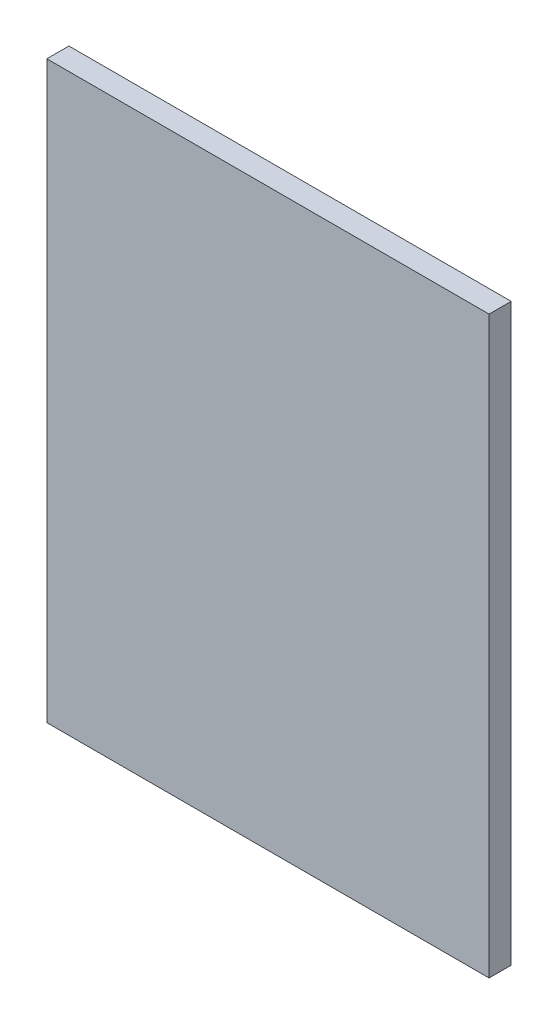
ISO-10303-21;
HEADER;
FILE_DESCRIPTION(('STEP AP214'),'2;1');
FILE_NAME('part.step','',(''),(''),'','','');
FILE_SCHEMA(('AUTOMOTIVE_DESIGN { 1 0 10303 214 1 1 1 1 }'));
ENDSEC;
DATA;
#1=APPLICATION_CONTEXT('core data for automotive mechanical design processes');
#2=APPLICATION_PROTOCOL_DEFINITION('international standard','automotive_design',2000,#1);
#3=PRODUCT_CONTEXT('',#1,'mechanical');
#4=PRODUCT('Part','Part','',(#3));
#5=PRODUCT_RELATED_PRODUCT_CATEGORY('part','',(#4));
#6=PRODUCT_DEFINITION_FORMATION('','',#4);
#7=PRODUCT_DEFINITION_CONTEXT('part definition',#1,'design');
#8=PRODUCT_DEFINITION('design','',#6,#7);
#9=PRODUCT_DEFINITION_SHAPE('','',#8);
#10=(LENGTH_UNIT() NAMED_UNIT(*) SI_UNIT(.MILLI.,.METRE.));
#11=(NAMED_UNIT(*) PLANE_ANGLE_UNIT() SI_UNIT($,.RADIAN.));
#12=(NAMED_UNIT(*) SI_UNIT($,.STERADIAN.) SOLID_ANGLE_UNIT());
#13=UNCERTAINTY_MEASURE_WITH_UNIT(LENGTH_MEASURE(1.E-05),#10,'distance_accuracy_value','');
#14=(GEOMETRIC_REPRESENTATION_CONTEXT(3) GLOBAL_UNCERTAINTY_ASSIGNED_CONTEXT((#13)) GLOBAL_UNIT_ASSIGNED_CONTEXT((#10,
#11,#12)) REPRESENTATION_CONTEXT('',''));
#15=CARTESIAN_POINT('',(0.,0.,0.));
#16=DIRECTION('',(0.,0.,1.));
#17=DIRECTION('',(1.,0.,0.));
#18=AXIS2_PLACEMENT_3D('',#15,#16,#17);
#19=CARTESIAN_POINT('',(-50.,-65.,5.));
#20=DIRECTION('',(1.,0.,0.));
#21=DIRECTION('',(0.,0.,-1.));
#22=AXIS2_PLACEMENT_3D('',#19,#20,#21);
#23=PLANE('',#22);
#24=DIRECTION('',(0.,-1.,0.));
#25=VECTOR('',#24,1.);
#26=CARTESIAN_POINT('',(-50.,-65.,0.));
#27=LINE('',#26,#25);
#28=CARTESIAN_POINT('',(-50.,65.,0.));
#29=VERTEX_POINT('',#28);
#30=CARTESIAN_POINT('',(-50.,-65.,0.));
#31=VERTEX_POINT('',#30);
#32=EDGE_CURVE('E100',#29,#31,#27,.T.);
#33=ORIENTED_EDGE('',*,*,#32,.T.);
#34=DIRECTION('',(0.,0.,-1.));
#35=VECTOR('',#34,1.);
#36=CARTESIAN_POINT('',(-50.,-65.,5.));
#37=LINE('',#36,#35);
#38=CARTESIAN_POINT('',(-50.,-65.,5.));
#39=VERTEX_POINT('',#38);
#40=EDGE_CURVE('E11',#39,#31,#37,.T.);
#41=ORIENTED_EDGE('',*,*,#40,.F.);
#42=DIRECTION('',(0.,-1.,0.));
#43=VECTOR('',#42,1.);
#44=CARTESIAN_POINT('',(-50.,-65.,5.));
#45=LINE('',#44,#43);
#46=CARTESIAN_POINT('',(-50.,65.,5.));
#47=VERTEX_POINT('',#46);
#48=EDGE_CURVE('E88',#47,#39,#45,.T.);
#49=ORIENTED_EDGE('',*,*,#48,.F.);
#50=DIRECTION('',(0.,0.,-1.));
#51=VECTOR('',#50,1.);
#52=CARTESIAN_POINT('',(-50.,65.,5.));
#53=LINE('',#52,#51);
#54=EDGE_CURVE('E96',#47,#29,#53,.T.);
#55=ORIENTED_EDGE('',*,*,#54,.T.);
#56=EDGE_LOOP('',(#33,#41,#49,#55));
#57=FACE_BOUND('',#56,.T.);
#58=ADVANCED_FACE('F37',(#57),#23,.F.);
#59=CARTESIAN_POINT('',(50.,-65.,5.));
#60=DIRECTION('',(0.,1.,0.));
#61=DIRECTION('',(-1.,0.,0.));
#62=AXIS2_PLACEMENT_3D('',#59,#60,#61);
#63=PLANE('',#62);
#64=DIRECTION('',(1.,0.,0.));
#65=VECTOR('',#64,1.);
#66=CARTESIAN_POINT('',(50.,-65.,0.));
#67=LINE('',#66,#65);
#68=CARTESIAN_POINT('',(50.,-65.,0.));
#69=VERTEX_POINT('',#68);
#70=EDGE_CURVE('E92',#31,#69,#67,.T.);
#71=ORIENTED_EDGE('',*,*,#70,.T.);
#72=DIRECTION('',(0.,0.,-1.));
#73=VECTOR('',#72,1.);
#74=CARTESIAN_POINT('',(50.,-65.,5.));
#75=LINE('',#74,#73);
#76=CARTESIAN_POINT('',(50.,-65.,5.));
#77=VERTEX_POINT('',#76);
#78=EDGE_CURVE('E45',#77,#69,#75,.T.);
#79=ORIENTED_EDGE('',*,*,#78,.F.);
#80=DIRECTION('',(1.,0.,0.));
#81=VECTOR('',#80,1.);
#82=CARTESIAN_POINT('',(50.,-65.,5.));
#83=LINE('',#82,#81);
#84=EDGE_CURVE('E83',#39,#77,#83,.T.);
#85=ORIENTED_EDGE('',*,*,#84,.F.);
#86=ORIENTED_EDGE('',*,*,#40,.T.);
#87=EDGE_LOOP('',(#71,#79,#85,#86));
#88=FACE_BOUND('',#87,.T.);
#89=ADVANCED_FACE('F91',(#88),#63,.F.);
#90=CARTESIAN_POINT('',(50.,-65.,5.));
#91=DIRECTION('',(-1.,0.,0.));
#92=DIRECTION('',(0.,0.,1.));
#93=AXIS2_PLACEMENT_3D('',#90,#91,#92);
#94=PLANE('',#93);
#95=DIRECTION('',(0.,1.,0.));
#96=VECTOR('',#95,1.);
#97=CARTESIAN_POINT('',(50.,-65.,0.));
#98=LINE('',#97,#96);
#99=CARTESIAN_POINT('',(50.,65.,0.));
#100=VERTEX_POINT('',#99);
#101=EDGE_CURVE('E70',#69,#100,#98,.T.);
#102=ORIENTED_EDGE('',*,*,#101,.T.);
#103=DIRECTION('',(0.,0.,-1.));
#104=VECTOR('',#103,1.);
#105=CARTESIAN_POINT('',(50.,65.,5.));
#106=LINE('',#105,#104);
#107=CARTESIAN_POINT('',(50.,65.,5.));
#108=VERTEX_POINT('',#107);
#109=EDGE_CURVE('E93',#108,#100,#106,.T.);
#110=ORIENTED_EDGE('',*,*,#109,.F.);
#111=DIRECTION('',(0.,1.,0.));
#112=VECTOR('',#111,1.);
#113=CARTESIAN_POINT('',(50.,-65.,5.));
#114=LINE('',#113,#112);
#115=EDGE_CURVE('E86',#77,#108,#114,.T.);
#116=ORIENTED_EDGE('',*,*,#115,.F.);
#117=ORIENTED_EDGE('',*,*,#78,.T.);
#118=EDGE_LOOP('',(#102,#110,#116,#117));
#119=FACE_BOUND('',#118,.T.);
#120=ADVANCED_FACE('F94',(#119),#94,.F.);
#121=CARTESIAN_POINT('',(50.,65.,5.));
#122=DIRECTION('',(0.,-1.,0.));
#123=DIRECTION('',(0.,0.,-1.));
#124=AXIS2_PLACEMENT_3D('',#121,#122,#123);
#125=PLANE('',#124);
#126=DIRECTION('',(-1.,0.,0.));
#127=VECTOR('',#126,1.);
#128=CARTESIAN_POINT('',(50.,65.,0.));
#129=LINE('',#128,#127);
#130=EDGE_CURVE('E76',#100,#29,#129,.T.);
#131=ORIENTED_EDGE('',*,*,#130,.T.);
#132=ORIENTED_EDGE('',*,*,#54,.F.);
#133=DIRECTION('',(-1.,0.,0.));
#134=VECTOR('',#133,1.);
#135=CARTESIAN_POINT('',(50.,65.,5.));
#136=LINE('',#135,#134);
#137=EDGE_CURVE('E53',#108,#47,#136,.T.);
#138=ORIENTED_EDGE('',*,*,#137,.F.);
#139=ORIENTED_EDGE('',*,*,#109,.T.);
#140=EDGE_LOOP('',(#131,#132,#138,#139));
#141=FACE_BOUND('',#140,.T.);
#142=ADVANCED_FACE('F107',(#141),#125,.F.);
#143=CARTESIAN_POINT('',(0.,0.,5.));
#144=DIRECTION('',(0.,0.,1.));
#145=DIRECTION('',(1.,0.,0.));
#146=AXIS2_PLACEMENT_3D('',#143,#144,#145);
#147=PLANE('',#146);
#148=ORIENTED_EDGE('',*,*,#48,.T.);
#149=ORIENTED_EDGE('',*,*,#84,.T.);
#150=ORIENTED_EDGE('',*,*,#115,.T.);
#151=ORIENTED_EDGE('',*,*,#137,.T.);
#152=EDGE_LOOP('',(#148,#149,#150,#151));
#153=FACE_BOUND('',#152,.T.);
#154=ADVANCED_FACE('F84',(#153),#147,.T.);
#155=CARTESIAN_POINT('',(0.,0.,0.));
#156=DIRECTION('',(0.,0.,1.));
#157=DIRECTION('',(1.,0.,0.));
#158=AXIS2_PLACEMENT_3D('',#155,#156,#157);
#159=PLANE('',#158);
#160=ORIENTED_EDGE('',*,*,#32,.F.);
#161=ORIENTED_EDGE('',*,*,#130,.F.);
#162=ORIENTED_EDGE('',*,*,#101,.F.);
#163=ORIENTED_EDGE('',*,*,#70,.F.);
#164=EDGE_LOOP('',(#160,#161,#162,#163));
#165=FACE_BOUND('',#164,.T.);
#166=ADVANCED_FACE('F110',(#165),#159,.F.);
#167=CLOSED_SHELL('',(#58,#89,#120,#142,#154,#166));
#168=MANIFOLD_SOLID_BREP('B2',#167);
#169=ADVANCED_BREP_SHAPE_REPRESENTATION('',(#18,#168),#14);
#170=SHAPE_DEFINITION_REPRESENTATION(#9,#169);
ENDSEC;
END-ISO-10303-21;
